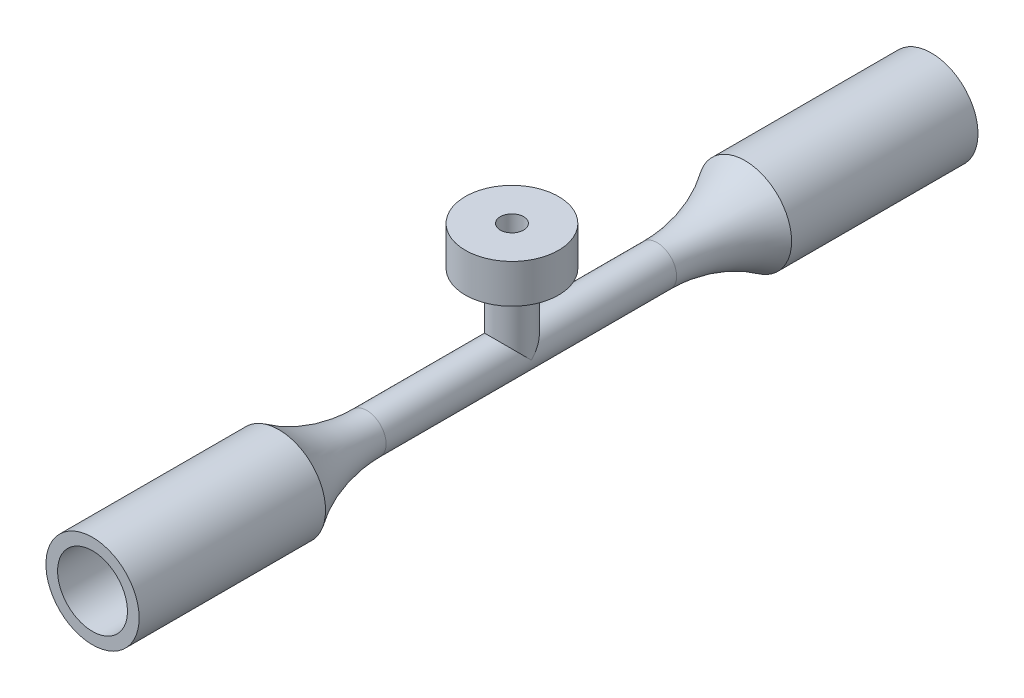
ISO-10303-21;
HEADER;
FILE_DESCRIPTION(('STEP AP214'),'2;1');
FILE_NAME('part.step','',(''),(''),'','','');
FILE_SCHEMA(('AUTOMOTIVE_DESIGN { 1 0 10303 214 1 1 1 1 }'));
ENDSEC;
DATA;
#1=APPLICATION_CONTEXT('core data for automotive mechanical design processes');
#2=APPLICATION_PROTOCOL_DEFINITION('international standard','automotive_design',2000,#1);
#3=PRODUCT_CONTEXT('',#1,'mechanical');
#4=PRODUCT('Part','Part','',(#3));
#5=PRODUCT_RELATED_PRODUCT_CATEGORY('part','',(#4));
#6=PRODUCT_DEFINITION_FORMATION('','',#4);
#7=PRODUCT_DEFINITION_CONTEXT('part definition',#1,'design');
#8=PRODUCT_DEFINITION('design','',#6,#7);
#9=PRODUCT_DEFINITION_SHAPE('','',#8);
#10=(LENGTH_UNIT() NAMED_UNIT(*) SI_UNIT(.MILLI.,.METRE.));
#11=(NAMED_UNIT(*) PLANE_ANGLE_UNIT() SI_UNIT($,.RADIAN.));
#12=(NAMED_UNIT(*) SI_UNIT($,.STERADIAN.) SOLID_ANGLE_UNIT());
#13=UNCERTAINTY_MEASURE_WITH_UNIT(LENGTH_MEASURE(1.E-05),#10,'distance_accuracy_value','');
#14=(GEOMETRIC_REPRESENTATION_CONTEXT(3) GLOBAL_UNCERTAINTY_ASSIGNED_CONTEXT((#13)) GLOBAL_UNIT_ASSIGNED_CONTEXT((#10,
#11,#12)) REPRESENTATION_CONTEXT('',''));
#15=CARTESIAN_POINT('',(0.,0.,0.));
#16=DIRECTION('',(0.,0.,1.));
#17=DIRECTION('',(1.,0.,0.));
#18=AXIS2_PLACEMENT_3D('',#15,#16,#17);
#19=CARTESIAN_POINT('',(0.,0.,27.));
#20=DIRECTION('',(0.,0.,-1.));
#21=DIRECTION('',(-1.,0.,0.));
#22=AXIS2_PLACEMENT_3D('',#19,#20,#21);
#23=CYLINDRICAL_SURFACE('',#22,1.25);
#24=CARTESIAN_POINT('',(0.,0.,17.6513272777287));
#25=DIRECTION('',(0.,0.,-1.));
#26=DIRECTION('',(-1.,0.,0.));
#27=AXIS2_PLACEMENT_3D('',#24,#25,#26);
#28=CIRCLE('',#27,1.25);
#29=CARTESIAN_POINT('',(-1.25,0.,17.6513272777287));
#30=VERTEX_POINT('',#29);
#31=EDGE_CURVE('E11',#30,#30,#28,.F.);
#32=ORIENTED_EDGE('',*,*,#31,.T.);
#33=EDGE_LOOP('',(#32));
#34=FACE_BOUND('',#33,.T.);
#35=CARTESIAN_POINT('',(0.,0.,27.));
#36=DIRECTION('',(0.,-0.707106781186547,-0.707106781186547));
#37=DIRECTION('',(0.,0.707106781186547,-0.707106781186547));
#38=AXIS2_PLACEMENT_3D('',#35,#36,#37);
#39=ELLIPSE('',#38,1.76776695296637,1.25);
#40=CARTESIAN_POINT('',(1.25,0.,27.));
#41=VERTEX_POINT('',#40);
#42=CARTESIAN_POINT('',(-1.25,0.,27.));
#43=VERTEX_POINT('',#42);
#44=EDGE_CURVE('E89',#41,#43,#39,.F.);
#45=ORIENTED_EDGE('',*,*,#44,.F.);
#46=CARTESIAN_POINT('',(0.,0.,27.));
#47=DIRECTION('',(0.,0.707106781186547,-0.707106781186547));
#48=DIRECTION('',(0.,0.707106781186547,0.707106781186547));
#49=AXIS2_PLACEMENT_3D('',#46,#47,#48);
#50=ELLIPSE('',#49,1.76776695296637,1.25);
#51=EDGE_CURVE('E61',#41,#43,#50,.F.);
#52=ORIENTED_EDGE('',*,*,#51,.T.);
#53=EDGE_LOOP('',(#45,#52));
#54=FACE_BOUND('',#53,.T.);
#55=CARTESIAN_POINT('',(0.,0.,36.3486727222713));
#56=DIRECTION('',(0.,0.,-1.));
#57=DIRECTION('',(-1.,0.,0.));
#58=AXIS2_PLACEMENT_3D('',#55,#56,#57);
#59=CIRCLE('',#58,1.25);
#60=CARTESIAN_POINT('',(-1.25,0.,36.3486727222713));
#61=VERTEX_POINT('',#60);
#62=EDGE_CURVE('E70',#61,#61,#59,.F.);
#63=ORIENTED_EDGE('',*,*,#62,.F.);
#64=EDGE_LOOP('',(#63));
#65=FACE_BOUND('',#64,.T.);
#66=ADVANCED_FACE('F39',(#34,#54,#65),#23,.T.);
#67=CARTESIAN_POINT('',(0.,0.,12.));
#68=DIRECTION('',(0.,0.,-1.));
#69=DIRECTION('',(-1.,0.,0.));
#70=AXIS2_PLACEMENT_3D('',#67,#68,#69);
#71=CYLINDRICAL_SURFACE('',#70,3.);
#72=CARTESIAN_POINT('',(0.,0.,12.));
#73=DIRECTION('',(0.,0.,1.));
#74=DIRECTION('',(1.,0.,0.));
#75=AXIS2_PLACEMENT_3D('',#72,#73,#74);
#76=CIRCLE('',#75,3.);
#77=CARTESIAN_POINT('',(3.,0.,12.));
#78=VERTEX_POINT('',#77);
#79=EDGE_CURVE('E75',#78,#78,#76,.T.);
#80=ORIENTED_EDGE('',*,*,#79,.F.);
#81=EDGE_LOOP('',(#80));
#82=FACE_BOUND('',#81,.T.);
#83=CARTESIAN_POINT('',(0.,0.,0.));
#84=DIRECTION('',(0.,0.,1.));
#85=DIRECTION('',(1.,0.,0.));
#86=AXIS2_PLACEMENT_3D('',#83,#84,#85);
#87=CIRCLE('',#86,3.);
#88=CARTESIAN_POINT('',(3.,0.,0.));
#89=VERTEX_POINT('',#88);
#90=EDGE_CURVE('E78',#89,#89,#87,.T.);
#91=ORIENTED_EDGE('',*,*,#90,.T.);
#92=EDGE_LOOP('',(#91));
#93=FACE_BOUND('',#92,.T.);
#94=ADVANCED_FACE('F157',(#82,#93),#71,.T.);
#95=CARTESIAN_POINT('',(0.,0.,0.));
#96=DIRECTION('',(0.,0.,1.));
#97=DIRECTION('',(1.,0.,0.));
#98=AXIS2_PLACEMENT_3D('',#95,#96,#97);
#99=PLANE('',#98);
#100=CARTESIAN_POINT('',(0.,0.,0.));
#101=DIRECTION('',(0.,0.,-1.));
#102=DIRECTION('',(-1.,0.,0.));
#103=AXIS2_PLACEMENT_3D('',#100,#101,#102);
#104=CIRCLE('',#103,2.25);
#105=CARTESIAN_POINT('',(-2.25,0.,0.));
#106=VERTEX_POINT('',#105);
#107=EDGE_CURVE('E85',#106,#106,#104,.T.);
#108=ORIENTED_EDGE('',*,*,#107,.F.);
#109=EDGE_LOOP('',(#108));
#110=FACE_BOUND('',#109,.T.);
#111=ORIENTED_EDGE('',*,*,#90,.F.);
#112=EDGE_LOOP('',(#111));
#113=FACE_BOUND('',#112,.T.);
#114=ADVANCED_FACE('F163',(#110,#113),#99,.F.);
#115=CARTESIAN_POINT('',(0.,4.5,27.));
#116=DIRECTION('',(0.,-1.,0.));
#117=DIRECTION('',(0.,0.,-1.));
#118=AXIS2_PLACEMENT_3D('',#115,#116,#117);
#119=CYLINDRICAL_SURFACE('',#118,1.25);
#120=ORIENTED_EDGE('',*,*,#51,.F.);
#121=ORIENTED_EDGE('',*,*,#44,.T.);
#122=EDGE_LOOP('',(#120,#121));
#123=FACE_BOUND('',#122,.T.);
#124=CARTESIAN_POINT('',(0.,4.5,27.));
#125=DIRECTION('',(0.,1.,0.));
#126=DIRECTION('',(0.,0.,1.));
#127=AXIS2_PLACEMENT_3D('',#124,#125,#126);
#128=CIRCLE('',#127,1.25);
#129=CARTESIAN_POINT('',(0.,4.5,28.25));
#130=VERTEX_POINT('',#129);
#131=EDGE_CURVE('E93',#130,#130,#128,.T.);
#132=ORIENTED_EDGE('',*,*,#131,.F.);
#133=EDGE_LOOP('',(#132));
#134=FACE_BOUND('',#133,.T.);
#135=ADVANCED_FACE('F167',(#123,#134),#119,.T.);
#136=CARTESIAN_POINT('',(0.,7.,27.));
#137=DIRECTION('',(0.,-1.,0.));
#138=DIRECTION('',(0.,0.,-1.));
#139=AXIS2_PLACEMENT_3D('',#136,#137,#138);
#140=CYLINDRICAL_SURFACE('',#139,3.);
#141=CARTESIAN_POINT('',(0.,4.5,27.));
#142=DIRECTION('',(0.,1.,0.));
#143=DIRECTION('',(0.,0.,1.));
#144=AXIS2_PLACEMENT_3D('',#141,#142,#143);
#145=CIRCLE('',#144,3.);
#146=CARTESIAN_POINT('',(0.,4.5,30.));
#147=VERTEX_POINT('',#146);
#148=EDGE_CURVE('E98',#147,#147,#145,.T.);
#149=ORIENTED_EDGE('',*,*,#148,.T.);
#150=EDGE_LOOP('',(#149));
#151=FACE_BOUND('',#150,.T.);
#152=CARTESIAN_POINT('',(0.,7.,27.));
#153=DIRECTION('',(0.,1.,0.));
#154=DIRECTION('',(0.,0.,1.));
#155=AXIS2_PLACEMENT_3D('',#152,#153,#154);
#156=CIRCLE('',#155,3.);
#157=CARTESIAN_POINT('',(0.,7.,30.));
#158=VERTEX_POINT('',#157);
#159=EDGE_CURVE('E97',#158,#158,#156,.T.);
#160=ORIENTED_EDGE('',*,*,#159,.F.);
#161=EDGE_LOOP('',(#160));
#162=FACE_BOUND('',#161,.T.);
#163=ADVANCED_FACE('F174',(#151,#162),#140,.T.);
#164=CARTESIAN_POINT('',(0.,7.,27.));
#165=DIRECTION('',(0.,1.,0.));
#166=DIRECTION('',(0.,0.,1.));
#167=AXIS2_PLACEMENT_3D('',#164,#165,#166);
#168=PLANE('',#167);
#169=ORIENTED_EDGE('',*,*,#159,.T.);
#170=EDGE_LOOP('',(#169));
#171=FACE_BOUND('',#170,.T.);
#172=CARTESIAN_POINT('',(0.,7.,27.));
#173=DIRECTION('',(0.,1.,0.));
#174=DIRECTION('',(0.,0.,-1.));
#175=AXIS2_PLACEMENT_3D('',#172,#173,#174);
#176=CIRCLE('',#175,0.75);
#177=CARTESIAN_POINT('',(0.,7.,26.25));
#178=VERTEX_POINT('',#177);
#179=EDGE_CURVE('E86',#178,#178,#176,.T.);
#180=ORIENTED_EDGE('',*,*,#179,.F.);
#181=EDGE_LOOP('',(#180));
#182=FACE_BOUND('',#181,.T.);
#183=ADVANCED_FACE('F193',(#171,#182),#168,.T.);
#184=CARTESIAN_POINT('',(0.,4.5,27.));
#185=DIRECTION('',(0.,1.,0.));
#186=DIRECTION('',(0.,0.,1.));
#187=AXIS2_PLACEMENT_3D('',#184,#185,#186);
#188=PLANE('',#187);
#189=ORIENTED_EDGE('',*,*,#148,.F.);
#190=EDGE_LOOP('',(#189));
#191=FACE_BOUND('',#190,.T.);
#192=ORIENTED_EDGE('',*,*,#131,.T.);
#193=EDGE_LOOP('',(#192));
#194=FACE_BOUND('',#193,.T.);
#195=ADVANCED_FACE('F184',(#191,#194),#188,.F.);
#196=CARTESIAN_POINT('',(0.,0.,10.5));
#197=DIRECTION('',(0.,0.,-1.));
#198=DIRECTION('',(-1.,0.,0.));
#199=AXIS2_PLACEMENT_3D('',#196,#197,#198);
#200=CYLINDRICAL_SURFACE('',#199,2.25);
#201=CARTESIAN_POINT('',(0.,0.,10.5));
#202=DIRECTION('',(0.,0.,-1.));
#203=DIRECTION('',(-1.,0.,0.));
#204=AXIS2_PLACEMENT_3D('',#201,#202,#203);
#205=CIRCLE('',#204,2.25);
#206=CARTESIAN_POINT('',(-2.25,0.,10.5));
#207=VERTEX_POINT('',#206);
#208=EDGE_CURVE('E102',#207,#207,#205,.T.);
#209=ORIENTED_EDGE('',*,*,#208,.F.);
#210=EDGE_LOOP('',(#209));
#211=FACE_BOUND('',#210,.T.);
#212=ORIENTED_EDGE('',*,*,#107,.T.);
#213=EDGE_LOOP('',(#212));
#214=FACE_BOUND('',#213,.T.);
#215=ADVANCED_FACE('F181',(#211,#214),#200,.F.);
#216=CARTESIAN_POINT('',(0.,0.,10.5));
#217=DIRECTION('',(0.,0.,-1.));
#218=DIRECTION('',(-1.,0.,0.));
#219=AXIS2_PLACEMENT_3D('',#216,#217,#218);
#220=PLANE('',#219);
#221=CARTESIAN_POINT('',(0.,0.,10.5));
#222=DIRECTION('',(0.,0.,-1.));
#223=DIRECTION('',(-1.,0.,0.));
#224=AXIS2_PLACEMENT_3D('',#221,#222,#223);
#225=CIRCLE('',#224,0.75);
#226=CARTESIAN_POINT('',(-0.75,0.,10.5));
#227=VERTEX_POINT('',#226);
#228=EDGE_CURVE('E81',#227,#227,#225,.T.);
#229=ORIENTED_EDGE('',*,*,#228,.F.);
#230=EDGE_LOOP('',(#229));
#231=FACE_BOUND('',#230,.T.);
#232=ORIENTED_EDGE('',*,*,#208,.T.);
#233=EDGE_LOOP('',(#232));
#234=FACE_BOUND('',#233,.T.);
#235=ADVANCED_FACE('F183',(#231,#234),#220,.T.);
#236=CARTESIAN_POINT('',(0.,0.,5.49999999999999));
#237=DIRECTION('',(0.,0.,1.));
#238=DIRECTION('',(1.,0.,0.));
#239=AXIS2_PLACEMENT_3D('',#236,#237,#238);
#240=CYLINDRICAL_SURFACE('',#239,0.75);
#241=ORIENTED_EDGE('',*,*,#228,.T.);
#242=EDGE_LOOP('',(#241));
#243=FACE_BOUND('',#242,.T.);
#244=CARTESIAN_POINT('',(0.,0.,27.));
#245=DIRECTION('',(0.,0.707106781186547,0.707106781186547));
#246=DIRECTION('',(0.,-0.707106781186547,0.707106781186547));
#247=AXIS2_PLACEMENT_3D('',#244,#245,#246);
#248=ELLIPSE('',#247,1.06066017177982,0.75);
#249=CARTESIAN_POINT('',(0.75,0.,27.));
#250=VERTEX_POINT('',#249);
#251=CARTESIAN_POINT('',(-0.75,0.,27.));
#252=VERTEX_POINT('',#251);
#253=EDGE_CURVE('E48',#250,#252,#248,.T.);
#254=ORIENTED_EDGE('',*,*,#253,.T.);
#255=CARTESIAN_POINT('',(0.,0.,27.));
#256=DIRECTION('',(0.,-0.707106781186547,0.707106781186547));
#257=DIRECTION('',(0.,-0.707106781186547,-0.707106781186547));
#258=AXIS2_PLACEMENT_3D('',#255,#256,#257);
#259=ELLIPSE('',#258,1.06066017177982,0.75);
#260=EDGE_CURVE('E54',#250,#252,#259,.T.);
#261=ORIENTED_EDGE('',*,*,#260,.F.);
#262=EDGE_LOOP('',(#254,#261));
#263=FACE_BOUND('',#262,.T.);
#264=CARTESIAN_POINT('',(0.,0.,43.5));
#265=DIRECTION('',(0.,0.,-1.));
#266=DIRECTION('',(-1.,0.,0.));
#267=AXIS2_PLACEMENT_3D('',#264,#265,#266);
#268=CIRCLE('',#267,0.75);
#269=CARTESIAN_POINT('',(-0.75,0.,43.5));
#270=VERTEX_POINT('',#269);
#271=EDGE_CURVE('E118',#270,#270,#268,.T.);
#272=ORIENTED_EDGE('',*,*,#271,.F.);
#273=EDGE_LOOP('',(#272));
#274=FACE_BOUND('',#273,.T.);
#275=ADVANCED_FACE('F67',(#243,#263,#274),#240,.F.);
#276=CARTESIAN_POINT('',(0.,0.,27.));
#277=DIRECTION('',(0.,1.,0.));
#278=DIRECTION('',(0.,0.,1.));
#279=AXIS2_PLACEMENT_3D('',#276,#277,#278);
#280=CYLINDRICAL_SURFACE('',#279,0.75);
#281=ORIENTED_EDGE('',*,*,#179,.T.);
#282=EDGE_LOOP('',(#281));
#283=FACE_BOUND('',#282,.T.);
#284=ORIENTED_EDGE('',*,*,#253,.F.);
#285=ORIENTED_EDGE('',*,*,#260,.T.);
#286=EDGE_LOOP('',(#284,#285));
#287=FACE_BOUND('',#286,.T.);
#288=ADVANCED_FACE('F73',(#283,#287),#280,.F.);
#289=CARTESIAN_POINT('',(0.,0.,17.6513272777287));
#290=DIRECTION('',(0.,0.,-1.));
#291=DIRECTION('',(-1.,0.,0.));
#292=AXIS2_PLACEMENT_3D('',#289,#290,#291);
#293=TOROIDAL_SURFACE('',#292,11.25,10.);
#294=ORIENTED_EDGE('',*,*,#79,.T.);
#295=EDGE_LOOP('',(#294));
#296=FACE_BOUND('',#295,.T.);
#297=ORIENTED_EDGE('',*,*,#31,.F.);
#298=EDGE_LOOP('',(#297));
#299=FACE_BOUND('',#298,.T.);
#300=ADVANCED_FACE('F41',(#296,#299),#293,.F.);
#301=CARTESIAN_POINT('',(0.,0.,42.));
#302=DIRECTION('',(0.,0.,1.));
#303=DIRECTION('',(-1.,0.,0.));
#304=AXIS2_PLACEMENT_3D('',#301,#302,#303);
#305=CYLINDRICAL_SURFACE('',#304,3.);
#306=CARTESIAN_POINT('',(0.,0.,42.));
#307=DIRECTION('',(0.,0.,1.));
#308=DIRECTION('',(1.,0.,0.));
#309=AXIS2_PLACEMENT_3D('',#306,#307,#308);
#310=CIRCLE('',#309,3.);
#311=CARTESIAN_POINT('',(3.,0.,42.));
#312=VERTEX_POINT('',#311);
#313=EDGE_CURVE('E71',#312,#312,#310,.T.);
#314=ORIENTED_EDGE('',*,*,#313,.T.);
#315=EDGE_LOOP('',(#314));
#316=FACE_BOUND('',#315,.T.);
#317=CARTESIAN_POINT('',(0.,0.,54.));
#318=DIRECTION('',(0.,0.,1.));
#319=DIRECTION('',(1.,0.,0.));
#320=AXIS2_PLACEMENT_3D('',#317,#318,#319);
#321=CIRCLE('',#320,3.);
#322=CARTESIAN_POINT('',(3.,0.,54.));
#323=VERTEX_POINT('',#322);
#324=EDGE_CURVE('E123',#323,#323,#321,.T.);
#325=ORIENTED_EDGE('',*,*,#324,.F.);
#326=EDGE_LOOP('',(#325));
#327=FACE_BOUND('',#326,.T.);
#328=ADVANCED_FACE('F217',(#316,#327),#305,.T.);
#329=CARTESIAN_POINT('',(0.,0.,54.));
#330=DIRECTION('',(0.,0.,-1.));
#331=DIRECTION('',(1.,0.,0.));
#332=AXIS2_PLACEMENT_3D('',#329,#330,#331);
#333=PLANE('',#332);
#334=CARTESIAN_POINT('',(0.,0.,54.));
#335=DIRECTION('',(0.,0.,-1.));
#336=DIRECTION('',(-1.,0.,0.));
#337=AXIS2_PLACEMENT_3D('',#334,#335,#336);
#338=CIRCLE('',#337,2.25);
#339=CARTESIAN_POINT('',(-2.25,0.,54.));
#340=VERTEX_POINT('',#339);
#341=EDGE_CURVE('E122',#340,#340,#338,.T.);
#342=ORIENTED_EDGE('',*,*,#341,.T.);
#343=EDGE_LOOP('',(#342));
#344=FACE_BOUND('',#343,.T.);
#345=ORIENTED_EDGE('',*,*,#324,.T.);
#346=EDGE_LOOP('',(#345));
#347=FACE_BOUND('',#346,.T.);
#348=ADVANCED_FACE('F154',(#344,#347),#333,.F.);
#349=CARTESIAN_POINT('',(0.,0.,43.5));
#350=DIRECTION('',(0.,0.,1.));
#351=DIRECTION('',(-1.,0.,0.));
#352=AXIS2_PLACEMENT_3D('',#349,#350,#351);
#353=CYLINDRICAL_SURFACE('',#352,2.25);
#354=CARTESIAN_POINT('',(0.,0.,43.5));
#355=DIRECTION('',(0.,0.,-1.));
#356=DIRECTION('',(-1.,0.,0.));
#357=AXIS2_PLACEMENT_3D('',#354,#355,#356);
#358=CIRCLE('',#357,2.25);
#359=CARTESIAN_POINT('',(-2.25,0.,43.5));
#360=VERTEX_POINT('',#359);
#361=EDGE_CURVE('E132',#360,#360,#358,.T.);
#362=ORIENTED_EDGE('',*,*,#361,.T.);
#363=EDGE_LOOP('',(#362));
#364=FACE_BOUND('',#363,.T.);
#365=ORIENTED_EDGE('',*,*,#341,.F.);
#366=EDGE_LOOP('',(#365));
#367=FACE_BOUND('',#366,.T.);
#368=ADVANCED_FACE('F140',(#364,#367),#353,.F.);
#369=CARTESIAN_POINT('',(0.,0.,43.5));
#370=DIRECTION('',(0.,0.,1.));
#371=DIRECTION('',(-1.,0.,0.));
#372=AXIS2_PLACEMENT_3D('',#369,#370,#371);
#373=PLANE('',#372);
#374=ORIENTED_EDGE('',*,*,#271,.T.);
#375=EDGE_LOOP('',(#374));
#376=FACE_BOUND('',#375,.T.);
#377=ORIENTED_EDGE('',*,*,#361,.F.);
#378=EDGE_LOOP('',(#377));
#379=FACE_BOUND('',#378,.T.);
#380=ADVANCED_FACE('F143',(#376,#379),#373,.T.);
#381=CARTESIAN_POINT('',(0.,0.,36.3486727222713));
#382=DIRECTION('',(0.,0.,1.));
#383=DIRECTION('',(-1.,0.,0.));
#384=AXIS2_PLACEMENT_3D('',#381,#382,#383);
#385=TOROIDAL_SURFACE('',#384,11.25,10.);
#386=ORIENTED_EDGE('',*,*,#313,.F.);
#387=EDGE_LOOP('',(#386));
#388=FACE_BOUND('',#387,.T.);
#389=ORIENTED_EDGE('',*,*,#62,.T.);
#390=EDGE_LOOP('',(#389));
#391=FACE_BOUND('',#390,.T.);
#392=ADVANCED_FACE('F145',(#388,#391),#385,.F.);
#393=CLOSED_SHELL('',(#66,#94,#114,#135,#163,#183,#195,#215,#235,#275,#288,#300,#328,#348,#368,
#380,#392));
#394=MANIFOLD_SOLID_BREP('B2',#393);
#395=ADVANCED_BREP_SHAPE_REPRESENTATION('',(#18,#394),#14);
#396=SHAPE_DEFINITION_REPRESENTATION(#9,#395);
ENDSEC;
END-ISO-10303-21;
